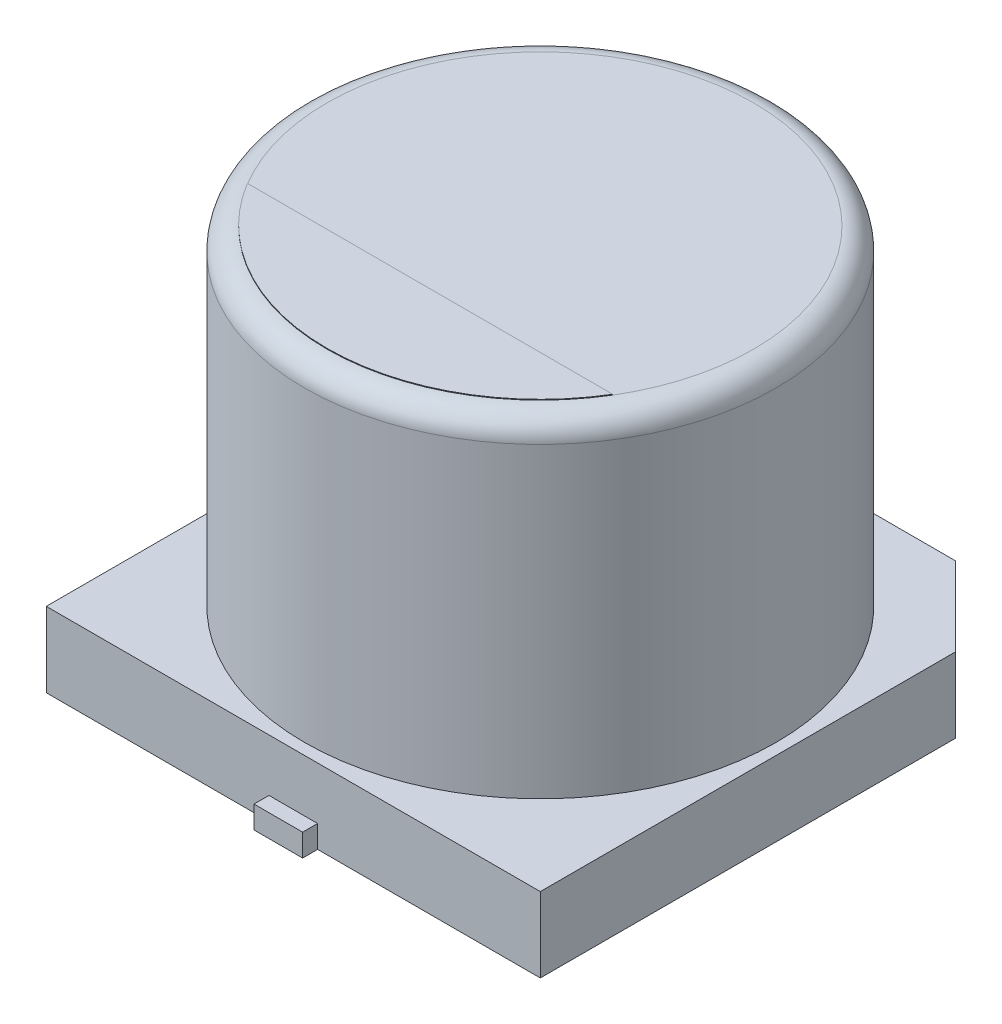
ISO-10303-21;
HEADER;
FILE_DESCRIPTION(('STEP AP214'),'2;1');
FILE_NAME('part.step','',(''),(''),'','','');
FILE_SCHEMA(('AUTOMOTIVE_DESIGN { 1 0 10303 214 1 1 1 1 }'));
ENDSEC;
DATA;
#1=APPLICATION_CONTEXT('core data for automotive mechanical design processes');
#2=APPLICATION_PROTOCOL_DEFINITION('international standard','automotive_design',2000,#1);
#3=PRODUCT_CONTEXT('',#1,'mechanical');
#4=PRODUCT('Part','Part','',(#3));
#5=PRODUCT_RELATED_PRODUCT_CATEGORY('part','',(#4));
#6=PRODUCT_DEFINITION_FORMATION('','',#4);
#7=PRODUCT_DEFINITION_CONTEXT('part definition',#1,'design');
#8=PRODUCT_DEFINITION('design','',#6,#7);
#9=PRODUCT_DEFINITION_SHAPE('','',#8);
#10=(LENGTH_UNIT() NAMED_UNIT(*) SI_UNIT(.MILLI.,.METRE.));
#11=(NAMED_UNIT(*) PLANE_ANGLE_UNIT() SI_UNIT($,.RADIAN.));
#12=(NAMED_UNIT(*) SI_UNIT($,.STERADIAN.) SOLID_ANGLE_UNIT());
#13=UNCERTAINTY_MEASURE_WITH_UNIT(LENGTH_MEASURE(1.E-05),#10,'distance_accuracy_value','');
#14=(GEOMETRIC_REPRESENTATION_CONTEXT(3) GLOBAL_UNCERTAINTY_ASSIGNED_CONTEXT((#13)) GLOBAL_UNIT_ASSIGNED_CONTEXT((#10,
#11,#12)) REPRESENTATION_CONTEXT('',''));
#15=CARTESIAN_POINT('',(0.,0.,0.));
#16=DIRECTION('',(0.,0.,1.));
#17=DIRECTION('',(1.,0.,0.));
#18=AXIS2_PLACEMENT_3D('',#15,#16,#17);
#19=CARTESIAN_POINT('',(0.,5.4,0.));
#20=DIRECTION('',(0.,1.,0.));
#21=DIRECTION('',(0.,0.,1.));
#22=AXIS2_PLACEMENT_3D('',#19,#20,#21);
#23=PLANE('',#22);
#24=CARTESIAN_POINT('',(0.,5.4,0.));
#25=DIRECTION('',(0.,1.,0.));
#26=DIRECTION('',(0.,0.,1.));
#27=AXIS2_PLACEMENT_3D('',#24,#25,#26);
#28=CIRCLE('',#27,2.85);
#29=CARTESIAN_POINT('',(2.43990814356065,5.4,1.47287075162298));
#30=VERTEX_POINT('',#29);
#31=CARTESIAN_POINT('',(-2.43990814356065,5.4,1.47287075162298));
#32=VERTEX_POINT('',#31);
#33=EDGE_CURVE('E221',#30,#32,#28,.T.);
#34=ORIENTED_EDGE('',*,*,#33,.T.);
#35=DIRECTION('',(-1.,0.,0.));
#36=VECTOR('',#35,1.);
#37=CARTESIAN_POINT('',(-2.43990814356065,5.4,1.47287075162298));
#38=LINE('',#37,#36);
#39=EDGE_CURVE('E159',#30,#32,#38,.T.);
#40=ORIENTED_EDGE('',*,*,#39,.F.);
#41=EDGE_LOOP('',(#34,#40));
#42=FACE_BOUND('',#41,.T.);
#43=ADVANCED_FACE('F33',(#42),#23,.T.);
#44=CARTESIAN_POINT('',(-2.25,1.,-3.3));
#45=DIRECTION('',(0.,0.,1.));
#46=DIRECTION('',(1.,0.,0.));
#47=AXIS2_PLACEMENT_3D('',#44,#45,#46);
#48=PLANE('',#47);
#49=DIRECTION('',(0.,-1.,0.));
#50=VECTOR('',#49,1.);
#51=CARTESIAN_POINT('',(0.325,1.,-3.3));
#52=LINE('',#51,#50);
#53=CARTESIAN_POINT('',(0.325,0.3,-3.3));
#54=VERTEX_POINT('',#53);
#55=CARTESIAN_POINT('',(0.325,0.,-3.3));
#56=VERTEX_POINT('',#55);
#57=EDGE_CURVE('E188',#54,#56,#52,.T.);
#58=ORIENTED_EDGE('',*,*,#57,.F.);
#59=DIRECTION('',(-1.,0.,0.));
#60=VECTOR('',#59,1.);
#61=CARTESIAN_POINT('',(-2.25,0.3,-3.3));
#62=LINE('',#61,#60);
#63=CARTESIAN_POINT('',(-0.325,0.3,-3.3));
#64=VERTEX_POINT('',#63);
#65=EDGE_CURVE('E11',#54,#64,#62,.T.);
#66=ORIENTED_EDGE('',*,*,#65,.T.);
#67=DIRECTION('',(0.,1.,0.));
#68=VECTOR('',#67,1.);
#69=CARTESIAN_POINT('',(-0.325,1.,-3.3));
#70=LINE('',#69,#68);
#71=CARTESIAN_POINT('',(-0.325,0.,-3.3));
#72=VERTEX_POINT('',#71);
#73=EDGE_CURVE('E186',#72,#64,#70,.T.);
#74=ORIENTED_EDGE('',*,*,#73,.F.);
#75=DIRECTION('',(-1.,0.,0.));
#76=VECTOR('',#75,1.);
#77=CARTESIAN_POINT('',(-2.25,0.,-3.3));
#78=LINE('',#77,#76);
#79=CARTESIAN_POINT('',(-2.25,0.,-3.3));
#80=VERTEX_POINT('',#79);
#81=EDGE_CURVE('E242',#72,#80,#78,.T.);
#82=ORIENTED_EDGE('',*,*,#81,.T.);
#83=DIRECTION('',(0.,-1.,0.));
#84=VECTOR('',#83,1.);
#85=CARTESIAN_POINT('',(-2.25,1.,-3.3));
#86=LINE('',#85,#84);
#87=CARTESIAN_POINT('',(-2.25,1.,-3.3));
#88=VERTEX_POINT('',#87);
#89=EDGE_CURVE('E259',#88,#80,#86,.T.);
#90=ORIENTED_EDGE('',*,*,#89,.F.);
#91=DIRECTION('',(-1.,0.,0.));
#92=VECTOR('',#91,1.);
#93=CARTESIAN_POINT('',(-2.25,1.,-3.3));
#94=LINE('',#93,#92);
#95=CARTESIAN_POINT('',(2.25,1.,-3.3));
#96=VERTEX_POINT('',#95);
#97=EDGE_CURVE('E229',#96,#88,#94,.T.);
#98=ORIENTED_EDGE('',*,*,#97,.F.);
#99=DIRECTION('',(0.,-1.,0.));
#100=VECTOR('',#99,1.);
#101=CARTESIAN_POINT('',(2.25,1.,-3.3));
#102=LINE('',#101,#100);
#103=CARTESIAN_POINT('',(2.25,0.,-3.3));
#104=VERTEX_POINT('',#103);
#105=EDGE_CURVE('E262',#96,#104,#102,.T.);
#106=ORIENTED_EDGE('',*,*,#105,.T.);
#107=EDGE_CURVE('E243',#104,#56,#78,.T.);
#108=ORIENTED_EDGE('',*,*,#107,.T.);
#109=EDGE_LOOP('',(#58,#66,#74,#82,#90,#98,#106,#108));
#110=FACE_BOUND('',#109,.T.);
#111=ADVANCED_FACE('F319',(#110),#48,.F.);
#112=CARTESIAN_POINT('',(3.3,1.,3.3));
#113=DIRECTION('',(0.,0.,-1.));
#114=DIRECTION('',(-1.,0.,0.));
#115=AXIS2_PLACEMENT_3D('',#112,#113,#114);
#116=PLANE('',#115);
#117=DIRECTION('',(0.,-1.,0.));
#118=VECTOR('',#117,1.);
#119=CARTESIAN_POINT('',(-0.325,1.,3.3));
#120=LINE('',#119,#118);
#121=CARTESIAN_POINT('',(-0.325,0.3,3.3));
#122=VERTEX_POINT('',#121);
#123=CARTESIAN_POINT('',(-0.325,0.,3.3));
#124=VERTEX_POINT('',#123);
#125=EDGE_CURVE('E214',#122,#124,#120,.T.);
#126=ORIENTED_EDGE('',*,*,#125,.F.);
#127=DIRECTION('',(-1.,0.,0.));
#128=VECTOR('',#127,1.);
#129=CARTESIAN_POINT('',(3.3,0.3,3.3));
#130=LINE('',#129,#128);
#131=CARTESIAN_POINT('',(0.325,0.3,3.3));
#132=VERTEX_POINT('',#131);
#133=EDGE_CURVE('E41',#132,#122,#130,.T.);
#134=ORIENTED_EDGE('',*,*,#133,.F.);
#135=DIRECTION('',(0.,1.,0.));
#136=VECTOR('',#135,1.);
#137=CARTESIAN_POINT('',(0.325,1.,3.3));
#138=LINE('',#137,#136);
#139=CARTESIAN_POINT('',(0.325,0.,3.3));
#140=VERTEX_POINT('',#139);
#141=EDGE_CURVE('E211',#140,#132,#138,.T.);
#142=ORIENTED_EDGE('',*,*,#141,.F.);
#143=DIRECTION('',(1.,0.,0.));
#144=VECTOR('',#143,1.);
#145=CARTESIAN_POINT('',(3.3,0.,3.3));
#146=LINE('',#145,#144);
#147=CARTESIAN_POINT('',(3.3,0.,3.3));
#148=VERTEX_POINT('',#147);
#149=EDGE_CURVE('E249',#140,#148,#146,.T.);
#150=ORIENTED_EDGE('',*,*,#149,.T.);
#151=DIRECTION('',(0.,-1.,0.));
#152=VECTOR('',#151,1.);
#153=CARTESIAN_POINT('',(3.3,1.,3.3));
#154=LINE('',#153,#152);
#155=CARTESIAN_POINT('',(3.3,1.,3.3));
#156=VERTEX_POINT('',#155);
#157=EDGE_CURVE('E237',#156,#148,#154,.T.);
#158=ORIENTED_EDGE('',*,*,#157,.F.);
#159=DIRECTION('',(1.,0.,0.));
#160=VECTOR('',#159,1.);
#161=CARTESIAN_POINT('',(3.3,1.,3.3));
#162=LINE('',#161,#160);
#163=CARTESIAN_POINT('',(-3.3,1.,3.3));
#164=VERTEX_POINT('',#163);
#165=EDGE_CURVE('E235',#164,#156,#162,.T.);
#166=ORIENTED_EDGE('',*,*,#165,.F.);
#167=DIRECTION('',(0.,-1.,0.));
#168=VECTOR('',#167,1.);
#169=CARTESIAN_POINT('',(-3.3,1.,3.3));
#170=LINE('',#169,#168);
#171=CARTESIAN_POINT('',(-3.3,0.,3.3));
#172=VERTEX_POINT('',#171);
#173=EDGE_CURVE('E253',#164,#172,#170,.T.);
#174=ORIENTED_EDGE('',*,*,#173,.T.);
#175=EDGE_CURVE('E227',#172,#124,#146,.T.);
#176=ORIENTED_EDGE('',*,*,#175,.T.);
#177=EDGE_LOOP('',(#126,#134,#142,#150,#158,#166,#174,#176));
#178=FACE_BOUND('',#177,.T.);
#179=ADVANCED_FACE('F289',(#178),#116,.F.);
#180=CARTESIAN_POINT('',(3.3,1.,-2.25));
#181=DIRECTION('',(-1.,0.,0.));
#182=DIRECTION('',(0.,0.,1.));
#183=AXIS2_PLACEMENT_3D('',#180,#181,#182);
#184=PLANE('',#183);
#185=DIRECTION('',(0.,0.,-1.));
#186=VECTOR('',#185,1.);
#187=CARTESIAN_POINT('',(3.3,0.,-2.25));
#188=LINE('',#187,#186);
#189=CARTESIAN_POINT('',(3.3,0.,-2.25));
#190=VERTEX_POINT('',#189);
#191=EDGE_CURVE('E217',#148,#190,#188,.T.);
#192=ORIENTED_EDGE('',*,*,#191,.T.);
#193=DIRECTION('',(0.,-1.,0.));
#194=VECTOR('',#193,1.);
#195=CARTESIAN_POINT('',(3.3,1.,-2.25));
#196=LINE('',#195,#194);
#197=CARTESIAN_POINT('',(3.3,1.,-2.25));
#198=VERTEX_POINT('',#197);
#199=EDGE_CURVE('E222',#198,#190,#196,.T.);
#200=ORIENTED_EDGE('',*,*,#199,.F.);
#201=DIRECTION('',(0.,0.,-1.));
#202=VECTOR('',#201,1.);
#203=CARTESIAN_POINT('',(3.3,1.,-2.25));
#204=LINE('',#203,#202);
#205=EDGE_CURVE('E223',#156,#198,#204,.T.);
#206=ORIENTED_EDGE('',*,*,#205,.F.);
#207=ORIENTED_EDGE('',*,*,#157,.T.);
#208=EDGE_LOOP('',(#192,#200,#206,#207));
#209=FACE_BOUND('',#208,.T.);
#210=ADVANCED_FACE('F296',(#209),#184,.F.);
#211=CARTESIAN_POINT('',(2.25,1.,-3.3));
#212=DIRECTION('',(-0.707106781186548,0.,0.707106781186547));
#213=DIRECTION('',(0.707106781186547,0.,0.707106781186548));
#214=AXIS2_PLACEMENT_3D('',#211,#212,#213);
#215=PLANE('',#214);
#216=DIRECTION('',(-0.707106781186547,0.,-0.707106781186548));
#217=VECTOR('',#216,1.);
#218=CARTESIAN_POINT('',(2.25,0.,-3.3));
#219=LINE('',#218,#217);
#220=EDGE_CURVE('E240',#190,#104,#219,.T.);
#221=ORIENTED_EDGE('',*,*,#220,.T.);
#222=ORIENTED_EDGE('',*,*,#105,.F.);
#223=DIRECTION('',(-0.707106781186547,0.,-0.707106781186548));
#224=VECTOR('',#223,1.);
#225=CARTESIAN_POINT('',(2.25,1.,-3.3));
#226=LINE('',#225,#224);
#227=EDGE_CURVE('E226',#198,#96,#226,.T.);
#228=ORIENTED_EDGE('',*,*,#227,.F.);
#229=ORIENTED_EDGE('',*,*,#199,.T.);
#230=EDGE_LOOP('',(#221,#222,#228,#229));
#231=FACE_BOUND('',#230,.T.);
#232=ADVANCED_FACE('F303',(#231),#215,.F.);
#233=CARTESIAN_POINT('',(-3.3,1.,-2.25));
#234=DIRECTION('',(0.707106781186547,0.,0.707106781186547));
#235=DIRECTION('',(0.707106781186548,0.,-0.707106781186548));
#236=AXIS2_PLACEMENT_3D('',#233,#234,#235);
#237=PLANE('',#236);
#238=DIRECTION('',(-0.707106781186548,0.,0.707106781186548));
#239=VECTOR('',#238,1.);
#240=CARTESIAN_POINT('',(-3.3,0.,-2.25));
#241=LINE('',#240,#239);
#242=CARTESIAN_POINT('',(-3.3,0.,-2.25));
#243=VERTEX_POINT('',#242);
#244=EDGE_CURVE('E245',#80,#243,#241,.T.);
#245=ORIENTED_EDGE('',*,*,#244,.T.);
#246=DIRECTION('',(0.,-1.,0.));
#247=VECTOR('',#246,1.);
#248=CARTESIAN_POINT('',(-3.3,1.,-2.25));
#249=LINE('',#248,#247);
#250=CARTESIAN_POINT('',(-3.3,1.,-2.25));
#251=VERTEX_POINT('',#250);
#252=EDGE_CURVE('E256',#251,#243,#249,.T.);
#253=ORIENTED_EDGE('',*,*,#252,.F.);
#254=DIRECTION('',(-0.707106781186548,0.,0.707106781186548));
#255=VECTOR('',#254,1.);
#256=CARTESIAN_POINT('',(-3.3,1.,-2.25));
#257=LINE('',#256,#255);
#258=EDGE_CURVE('E231',#88,#251,#257,.T.);
#259=ORIENTED_EDGE('',*,*,#258,.F.);
#260=ORIENTED_EDGE('',*,*,#89,.T.);
#261=EDGE_LOOP('',(#245,#253,#259,#260));
#262=FACE_BOUND('',#261,.T.);
#263=ADVANCED_FACE('F317',(#262),#237,.F.);
#264=CARTESIAN_POINT('',(-3.3,1.,3.3));
#265=DIRECTION('',(1.,0.,0.));
#266=DIRECTION('',(0.,0.,-1.));
#267=AXIS2_PLACEMENT_3D('',#264,#265,#266);
#268=PLANE('',#267);
#269=DIRECTION('',(0.,0.,1.));
#270=VECTOR('',#269,1.);
#271=CARTESIAN_POINT('',(-3.3,0.,3.3));
#272=LINE('',#271,#270);
#273=EDGE_CURVE('E247',#243,#172,#272,.T.);
#274=ORIENTED_EDGE('',*,*,#273,.T.);
#275=ORIENTED_EDGE('',*,*,#173,.F.);
#276=DIRECTION('',(0.,0.,1.));
#277=VECTOR('',#276,1.);
#278=CARTESIAN_POINT('',(-3.3,1.,3.3));
#279=LINE('',#278,#277);
#280=EDGE_CURVE('E233',#251,#164,#279,.T.);
#281=ORIENTED_EDGE('',*,*,#280,.F.);
#282=ORIENTED_EDGE('',*,*,#252,.T.);
#283=EDGE_LOOP('',(#274,#275,#281,#282));
#284=FACE_BOUND('',#283,.T.);
#285=ADVANCED_FACE('F313',(#284),#268,.F.);
#286=CARTESIAN_POINT('',(0.,1.,0.));
#287=DIRECTION('',(0.,-1.,0.));
#288=DIRECTION('',(0.,0.,-1.));
#289=AXIS2_PLACEMENT_3D('',#286,#287,#288);
#290=PLANE('',#289);
#291=CARTESIAN_POINT('',(0.,1.,0.));
#292=DIRECTION('',(0.,-1.,0.));
#293=DIRECTION('',(0.,0.,-1.));
#294=AXIS2_PLACEMENT_3D('',#291,#292,#293);
#295=CIRCLE('',#294,3.15);
#296=CARTESIAN_POINT('',(0.,1.,-3.15));
#297=VERTEX_POINT('',#296);
#298=EDGE_CURVE('E218',#297,#297,#295,.F.);
#299=ORIENTED_EDGE('',*,*,#298,.F.);
#300=EDGE_LOOP('',(#299));
#301=FACE_BOUND('',#300,.T.);
#302=ORIENTED_EDGE('',*,*,#205,.T.);
#303=ORIENTED_EDGE('',*,*,#227,.T.);
#304=ORIENTED_EDGE('',*,*,#97,.T.);
#305=ORIENTED_EDGE('',*,*,#258,.T.);
#306=ORIENTED_EDGE('',*,*,#280,.T.);
#307=ORIENTED_EDGE('',*,*,#165,.T.);
#308=EDGE_LOOP('',(#302,#303,#304,#305,#306,#307));
#309=FACE_BOUND('',#308,.T.);
#310=ADVANCED_FACE('F306',(#301,#309),#290,.F.);
#311=CARTESIAN_POINT('',(0.,0.,0.));
#312=DIRECTION('',(0.,-1.,0.));
#313=DIRECTION('',(0.,0.,-1.));
#314=AXIS2_PLACEMENT_3D('',#311,#312,#313);
#315=PLANE('',#314);
#316=ORIENTED_EDGE('',*,*,#81,.F.);
#317=DIRECTION('',(0.,0.,1.));
#318=VECTOR('',#317,1.);
#319=CARTESIAN_POINT('',(-0.325,0.,-0.9));
#320=LINE('',#319,#318);
#321=CARTESIAN_POINT('',(-0.325,0.,-3.5));
#322=VERTEX_POINT('',#321);
#323=EDGE_CURVE('E172',#322,#72,#320,.T.);
#324=ORIENTED_EDGE('',*,*,#323,.F.);
#325=DIRECTION('',(-1.,0.,0.));
#326=VECTOR('',#325,1.);
#327=CARTESIAN_POINT('',(0.325,0.,-3.5));
#328=LINE('',#327,#326);
#329=CARTESIAN_POINT('',(0.325,0.,-3.5));
#330=VERTEX_POINT('',#329);
#331=EDGE_CURVE('E164',#330,#322,#328,.T.);
#332=ORIENTED_EDGE('',*,*,#331,.F.);
#333=DIRECTION('',(0.,0.,-1.));
#334=VECTOR('',#333,1.);
#335=CARTESIAN_POINT('',(0.325,0.,-0.9));
#336=LINE('',#335,#334);
#337=EDGE_CURVE('E162',#56,#330,#336,.T.);
#338=ORIENTED_EDGE('',*,*,#337,.F.);
#339=ORIENTED_EDGE('',*,*,#107,.F.);
#340=ORIENTED_EDGE('',*,*,#220,.F.);
#341=ORIENTED_EDGE('',*,*,#191,.F.);
#342=ORIENTED_EDGE('',*,*,#149,.F.);
#343=DIRECTION('',(0.,0.,-1.));
#344=VECTOR('',#343,1.);
#345=CARTESIAN_POINT('',(0.325,0.,0.9));
#346=LINE('',#345,#344);
#347=CARTESIAN_POINT('',(0.325,0.,3.5));
#348=VERTEX_POINT('',#347);
#349=EDGE_CURVE('E195',#348,#140,#346,.T.);
#350=ORIENTED_EDGE('',*,*,#349,.F.);
#351=DIRECTION('',(1.,0.,0.));
#352=VECTOR('',#351,1.);
#353=CARTESIAN_POINT('',(0.325,0.,3.5));
#354=LINE('',#353,#352);
#355=CARTESIAN_POINT('',(-0.325,0.,3.5));
#356=VERTEX_POINT('',#355);
#357=EDGE_CURVE('E202',#356,#348,#354,.T.);
#358=ORIENTED_EDGE('',*,*,#357,.F.);
#359=DIRECTION('',(0.,0.,1.));
#360=VECTOR('',#359,1.);
#361=CARTESIAN_POINT('',(-0.325,0.,0.9));
#362=LINE('',#361,#360);
#363=EDGE_CURVE('E191',#124,#356,#362,.T.);
#364=ORIENTED_EDGE('',*,*,#363,.F.);
#365=ORIENTED_EDGE('',*,*,#175,.F.);
#366=ORIENTED_EDGE('',*,*,#273,.F.);
#367=ORIENTED_EDGE('',*,*,#244,.F.);
#368=EDGE_LOOP('',(#316,#324,#332,#338,#339,#340,#341,#342,#350,#358,#364,#365,#366,#367));
#369=FACE_BOUND('',#368,.T.);
#370=ADVANCED_FACE('F298',(#369),#315,.T.);
#371=CARTESIAN_POINT('',(0.,5.4,0.));
#372=DIRECTION('',(0.,-1.,0.));
#373=DIRECTION('',(0.,0.,-1.));
#374=AXIS2_PLACEMENT_3D('',#371,#372,#373);
#375=CYLINDRICAL_SURFACE('',#374,3.15);
#376=CARTESIAN_POINT('',(0.,5.1,0.));
#377=DIRECTION('',(0.,1.,0.));
#378=DIRECTION('',(0.,0.,1.));
#379=AXIS2_PLACEMENT_3D('',#376,#377,#378);
#380=CIRCLE('',#379,3.15);
#381=CARTESIAN_POINT('',(0.,5.1,3.15));
#382=VERTEX_POINT('',#381);
#383=EDGE_CURVE('E268',#382,#382,#380,.F.);
#384=ORIENTED_EDGE('',*,*,#383,.T.);
#385=EDGE_LOOP('',(#384));
#386=FACE_BOUND('',#385,.T.);
#387=ORIENTED_EDGE('',*,*,#298,.T.);
#388=EDGE_LOOP('',(#387));
#389=FACE_BOUND('',#388,.T.);
#390=ADVANCED_FACE('F354',(#386,#389),#375,.T.);
#391=CARTESIAN_POINT('',(0.,5.1,0.));
#392=DIRECTION('',(0.,1.,0.));
#393=DIRECTION('',(0.,0.,1.));
#394=AXIS2_PLACEMENT_3D('',#391,#392,#393);
#395=TOROIDAL_SURFACE('',#394,2.85,0.3);
#396=ORIENTED_EDGE('',*,*,#383,.F.);
#397=EDGE_LOOP('',(#396));
#398=FACE_BOUND('',#397,.T.);
#399=ORIENTED_EDGE('',*,*,#33,.F.);
#400=CARTESIAN_POINT('',(0.,5.4,0.));
#401=DIRECTION('',(0.,1.,0.));
#402=DIRECTION('',(0.,0.,1.));
#403=AXIS2_PLACEMENT_3D('',#400,#401,#402);
#404=CIRCLE('',#403,2.85);
#405=EDGE_CURVE('E47',#32,#30,#404,.T.);
#406=ORIENTED_EDGE('',*,*,#405,.F.);
#407=EDGE_LOOP('',(#399,#406));
#408=FACE_BOUND('',#407,.T.);
#409=ADVANCED_FACE('F35',(#398,#408),#395,.T.);
#410=CARTESIAN_POINT('',(0.,0.3,0.));
#411=DIRECTION('',(0.,-1.,0.));
#412=DIRECTION('',(0.,0.,-1.));
#413=AXIS2_PLACEMENT_3D('',#410,#411,#412);
#414=PLANE('',#413);
#415=DIRECTION('',(0.,0.,-1.));
#416=VECTOR('',#415,1.);
#417=CARTESIAN_POINT('',(0.325,0.3,0.9));
#418=LINE('',#417,#416);
#419=CARTESIAN_POINT('',(0.325,0.3,3.5));
#420=VERTEX_POINT('',#419);
#421=EDGE_CURVE('E197',#420,#132,#418,.T.);
#422=ORIENTED_EDGE('',*,*,#421,.T.);
#423=ORIENTED_EDGE('',*,*,#133,.T.);
#424=DIRECTION('',(0.,0.,1.));
#425=VECTOR('',#424,1.);
#426=CARTESIAN_POINT('',(-0.325,0.3,0.9));
#427=LINE('',#426,#425);
#428=CARTESIAN_POINT('',(-0.325,0.3,3.5));
#429=VERTEX_POINT('',#428);
#430=EDGE_CURVE('E192',#122,#429,#427,.T.);
#431=ORIENTED_EDGE('',*,*,#430,.T.);
#432=DIRECTION('',(1.,0.,0.));
#433=VECTOR('',#432,1.);
#434=CARTESIAN_POINT('',(0.325,0.3,3.5));
#435=LINE('',#434,#433);
#436=EDGE_CURVE('E194',#429,#420,#435,.T.);
#437=ORIENTED_EDGE('',*,*,#436,.T.);
#438=EDGE_LOOP('',(#422,#423,#431,#437));
#439=FACE_BOUND('',#438,.T.);
#440=ADVANCED_FACE('F273',(#439),#414,.F.);
#441=CARTESIAN_POINT('',(-0.325,0.3,0.9));
#442=DIRECTION('',(1.,0.,0.));
#443=DIRECTION('',(0.,0.,-1.));
#444=AXIS2_PLACEMENT_3D('',#441,#442,#443);
#445=PLANE('',#444);
#446=ORIENTED_EDGE('',*,*,#430,.F.);
#447=ORIENTED_EDGE('',*,*,#125,.T.);
#448=ORIENTED_EDGE('',*,*,#363,.T.);
#449=DIRECTION('',(0.,-1.,0.));
#450=VECTOR('',#449,1.);
#451=CARTESIAN_POINT('',(-0.325,0.3,3.5));
#452=LINE('',#451,#450);
#453=EDGE_CURVE('E208',#429,#356,#452,.T.);
#454=ORIENTED_EDGE('',*,*,#453,.F.);
#455=EDGE_LOOP('',(#446,#447,#448,#454));
#456=FACE_BOUND('',#455,.T.);
#457=ADVANCED_FACE('F280',(#456),#445,.F.);
#458=CARTESIAN_POINT('',(0.325,0.3,0.9));
#459=DIRECTION('',(-1.,0.,0.));
#460=DIRECTION('',(0.,0.,1.));
#461=AXIS2_PLACEMENT_3D('',#458,#459,#460);
#462=PLANE('',#461);
#463=ORIENTED_EDGE('',*,*,#349,.T.);
#464=ORIENTED_EDGE('',*,*,#141,.T.);
#465=ORIENTED_EDGE('',*,*,#421,.F.);
#466=DIRECTION('',(0.,-1.,0.));
#467=VECTOR('',#466,1.);
#468=CARTESIAN_POINT('',(0.325,0.3,3.5));
#469=LINE('',#468,#467);
#470=EDGE_CURVE('E200',#420,#348,#469,.T.);
#471=ORIENTED_EDGE('',*,*,#470,.T.);
#472=EDGE_LOOP('',(#463,#464,#465,#471));
#473=FACE_BOUND('',#472,.T.);
#474=ADVANCED_FACE('F288',(#473),#462,.F.);
#475=CARTESIAN_POINT('',(0.325,0.3,3.5));
#476=DIRECTION('',(0.,0.,-1.));
#477=DIRECTION('',(-1.,0.,0.));
#478=AXIS2_PLACEMENT_3D('',#475,#476,#477);
#479=PLANE('',#478);
#480=ORIENTED_EDGE('',*,*,#357,.T.);
#481=ORIENTED_EDGE('',*,*,#470,.F.);
#482=ORIENTED_EDGE('',*,*,#436,.F.);
#483=ORIENTED_EDGE('',*,*,#453,.T.);
#484=EDGE_LOOP('',(#480,#481,#482,#483));
#485=FACE_BOUND('',#484,.T.);
#486=ADVANCED_FACE('F284',(#485),#479,.F.);
#487=CARTESIAN_POINT('',(0.,0.3,0.));
#488=DIRECTION('',(0.,1.,0.));
#489=DIRECTION('',(0.,0.,1.));
#490=AXIS2_PLACEMENT_3D('',#487,#488,#489);
#491=PLANE('',#490);
#492=ORIENTED_EDGE('',*,*,#65,.F.);
#493=DIRECTION('',(0.,0.,-1.));
#494=VECTOR('',#493,1.);
#495=CARTESIAN_POINT('',(0.325,0.3,-0.9));
#496=LINE('',#495,#494);
#497=CARTESIAN_POINT('',(0.325,0.3,-3.5));
#498=VERTEX_POINT('',#497);
#499=EDGE_CURVE('E169',#54,#498,#496,.T.);
#500=ORIENTED_EDGE('',*,*,#499,.T.);
#501=DIRECTION('',(-1.,0.,0.));
#502=VECTOR('',#501,1.);
#503=CARTESIAN_POINT('',(0.325,0.3,-3.5));
#504=LINE('',#503,#502);
#505=CARTESIAN_POINT('',(-0.325,0.3,-3.5));
#506=VERTEX_POINT('',#505);
#507=EDGE_CURVE('E171',#498,#506,#504,.T.);
#508=ORIENTED_EDGE('',*,*,#507,.T.);
#509=DIRECTION('',(0.,0.,1.));
#510=VECTOR('',#509,1.);
#511=CARTESIAN_POINT('',(-0.325,0.3,-0.9));
#512=LINE('',#511,#510);
#513=EDGE_CURVE('E174',#506,#64,#512,.T.);
#514=ORIENTED_EDGE('',*,*,#513,.T.);
#515=EDGE_LOOP('',(#492,#500,#508,#514));
#516=FACE_BOUND('',#515,.T.);
#517=ADVANCED_FACE('F334',(#516),#491,.T.);
#518=CARTESIAN_POINT('',(0.325,0.3,-0.9));
#519=DIRECTION('',(-1.,0.,0.));
#520=DIRECTION('',(0.,0.,1.));
#521=AXIS2_PLACEMENT_3D('',#518,#519,#520);
#522=PLANE('',#521);
#523=ORIENTED_EDGE('',*,*,#499,.F.);
#524=ORIENTED_EDGE('',*,*,#57,.T.);
#525=ORIENTED_EDGE('',*,*,#337,.T.);
#526=DIRECTION('',(0.,-1.,0.));
#527=VECTOR('',#526,1.);
#528=CARTESIAN_POINT('',(0.325,0.3,-3.5));
#529=LINE('',#528,#527);
#530=EDGE_CURVE('E183',#498,#330,#529,.T.);
#531=ORIENTED_EDGE('',*,*,#530,.F.);
#532=EDGE_LOOP('',(#523,#524,#525,#531));
#533=FACE_BOUND('',#532,.T.);
#534=ADVANCED_FACE('F332',(#533),#522,.F.);
#535=CARTESIAN_POINT('',(-0.325,0.3,-0.9));
#536=DIRECTION('',(1.,0.,0.));
#537=DIRECTION('',(0.,0.,-1.));
#538=AXIS2_PLACEMENT_3D('',#535,#536,#537);
#539=PLANE('',#538);
#540=ORIENTED_EDGE('',*,*,#323,.T.);
#541=ORIENTED_EDGE('',*,*,#73,.T.);
#542=ORIENTED_EDGE('',*,*,#513,.F.);
#543=DIRECTION('',(0.,-1.,0.));
#544=VECTOR('',#543,1.);
#545=CARTESIAN_POINT('',(-0.325,0.3,-3.5));
#546=LINE('',#545,#544);
#547=EDGE_CURVE('E176',#506,#322,#546,.T.);
#548=ORIENTED_EDGE('',*,*,#547,.T.);
#549=EDGE_LOOP('',(#540,#541,#542,#548));
#550=FACE_BOUND('',#549,.T.);
#551=ADVANCED_FACE('F323',(#550),#539,.F.);
#552=CARTESIAN_POINT('',(0.325,0.3,-3.5));
#553=DIRECTION('',(0.,0.,1.));
#554=DIRECTION('',(1.,0.,0.));
#555=AXIS2_PLACEMENT_3D('',#552,#553,#554);
#556=PLANE('',#555);
#557=ORIENTED_EDGE('',*,*,#331,.T.);
#558=ORIENTED_EDGE('',*,*,#547,.F.);
#559=ORIENTED_EDGE('',*,*,#507,.F.);
#560=ORIENTED_EDGE('',*,*,#530,.T.);
#561=EDGE_LOOP('',(#557,#558,#559,#560));
#562=FACE_BOUND('',#561,.T.);
#563=ADVANCED_FACE('F328',(#562),#556,.F.);
#564=CARTESIAN_POINT('',(0.,5.41,0.));
#565=DIRECTION('',(0.,-1.,0.));
#566=DIRECTION('',(0.,0.,-1.));
#567=AXIS2_PLACEMENT_3D('',#564,#565,#566);
#568=CYLINDRICAL_SURFACE('',#567,2.85);
#569=ORIENTED_EDGE('',*,*,#405,.T.);
#570=DIRECTION('',(0.,-1.,0.));
#571=VECTOR('',#570,1.);
#572=CARTESIAN_POINT('',(2.43990814356065,5.41,1.47287075162298));
#573=LINE('',#572,#571);
#574=CARTESIAN_POINT('',(2.43990814356065,5.41,1.47287075162298));
#575=VERTEX_POINT('',#574);
#576=EDGE_CURVE('E150',#575,#30,#573,.T.);
#577=ORIENTED_EDGE('',*,*,#576,.F.);
#578=CARTESIAN_POINT('',(0.,5.41,0.));
#579=DIRECTION('',(0.,1.,0.));
#580=DIRECTION('',(0.,0.,1.));
#581=AXIS2_PLACEMENT_3D('',#578,#579,#580);
#582=CIRCLE('',#581,2.85);
#583=CARTESIAN_POINT('',(-2.43990814356065,5.41,1.47287075162298));
#584=VERTEX_POINT('',#583);
#585=EDGE_CURVE('E155',#584,#575,#582,.T.);
#586=ORIENTED_EDGE('',*,*,#585,.F.);
#587=DIRECTION('',(0.,-1.,0.));
#588=VECTOR('',#587,1.);
#589=CARTESIAN_POINT('',(-2.43990814356065,5.41,1.47287075162298));
#590=LINE('',#589,#588);
#591=EDGE_CURVE('E152',#584,#32,#590,.T.);
#592=ORIENTED_EDGE('',*,*,#591,.T.);
#593=EDGE_LOOP('',(#569,#577,#586,#592));
#594=FACE_BOUND('',#593,.T.);
#595=ADVANCED_FACE('F161',(#594),#568,.T.);
#596=CARTESIAN_POINT('',(-2.43990814356065,5.41,1.47287075162298));
#597=DIRECTION('',(0.,0.,1.));
#598=DIRECTION('',(1.,0.,0.));
#599=AXIS2_PLACEMENT_3D('',#596,#597,#598);
#600=PLANE('',#599);
#601=ORIENTED_EDGE('',*,*,#39,.T.);
#602=ORIENTED_EDGE('',*,*,#591,.F.);
#603=DIRECTION('',(-1.,0.,0.));
#604=VECTOR('',#603,1.);
#605=CARTESIAN_POINT('',(-2.43990814356065,5.41,1.47287075162298));
#606=LINE('',#605,#604);
#607=EDGE_CURVE('E145',#575,#584,#606,.T.);
#608=ORIENTED_EDGE('',*,*,#607,.F.);
#609=ORIENTED_EDGE('',*,*,#576,.T.);
#610=EDGE_LOOP('',(#601,#602,#608,#609));
#611=FACE_BOUND('',#610,.T.);
#612=ADVANCED_FACE('F148',(#611),#600,.F.);
#613=CARTESIAN_POINT('',(0.,5.41,0.));
#614=DIRECTION('',(0.,1.,0.));
#615=DIRECTION('',(0.,0.,1.));
#616=AXIS2_PLACEMENT_3D('',#613,#614,#615);
#617=PLANE('',#616);
#618=ORIENTED_EDGE('',*,*,#585,.T.);
#619=ORIENTED_EDGE('',*,*,#607,.T.);
#620=EDGE_LOOP('',(#618,#619));
#621=FACE_BOUND('',#620,.T.);
#622=ADVANCED_FACE('F157',(#621),#617,.T.);
#623=CLOSED_SHELL('',(#43,#111,#179,#210,#232,#263,#285,#310,#370,#390,#409,#440,#457,#474,#486,
#517,#534,#551,#563,#595,#612,#622));
#624=MANIFOLD_SOLID_BREP('B2',#623);
#625=ADVANCED_BREP_SHAPE_REPRESENTATION('',(#18,#624),#14);
#626=SHAPE_DEFINITION_REPRESENTATION(#9,#625);
ENDSEC;
END-ISO-10303-21;
